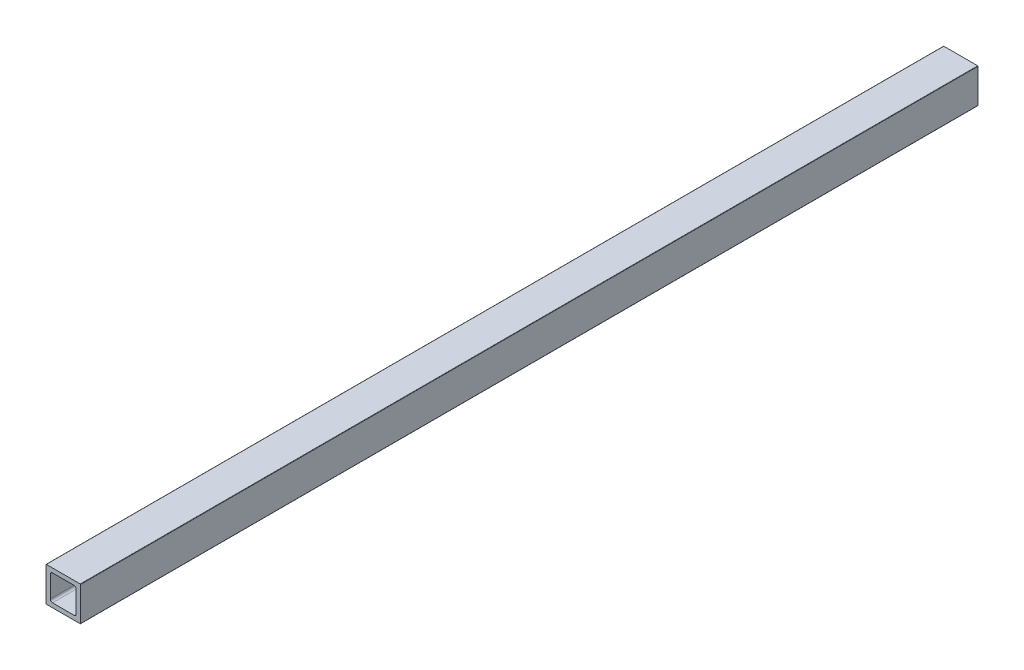
ISO-10303-21;
HEADER;
FILE_DESCRIPTION(('STEP AP214'),'2;1');
FILE_NAME('part.step','',(''),(''),'','','');
FILE_SCHEMA(('AUTOMOTIVE_DESIGN { 1 0 10303 214 1 1 1 1 }'));
ENDSEC;
DATA;
#1=APPLICATION_CONTEXT('core data for automotive mechanical design processes');
#2=APPLICATION_PROTOCOL_DEFINITION('international standard','automotive_design',2000,#1);
#3=PRODUCT_CONTEXT('',#1,'mechanical');
#4=PRODUCT('Part','Part','',(#3));
#5=PRODUCT_RELATED_PRODUCT_CATEGORY('part','',(#4));
#6=PRODUCT_DEFINITION_FORMATION('','',#4);
#7=PRODUCT_DEFINITION_CONTEXT('part definition',#1,'design');
#8=PRODUCT_DEFINITION('design','',#6,#7);
#9=PRODUCT_DEFINITION_SHAPE('','',#8);
#10=(LENGTH_UNIT() NAMED_UNIT(*) SI_UNIT(.MILLI.,.METRE.));
#11=(NAMED_UNIT(*) PLANE_ANGLE_UNIT() SI_UNIT($,.RADIAN.));
#12=(NAMED_UNIT(*) SI_UNIT($,.STERADIAN.) SOLID_ANGLE_UNIT());
#13=UNCERTAINTY_MEASURE_WITH_UNIT(LENGTH_MEASURE(1.E-05),#10,'distance_accuracy_value','');
#14=(GEOMETRIC_REPRESENTATION_CONTEXT(3) GLOBAL_UNCERTAINTY_ASSIGNED_CONTEXT((#13)) GLOBAL_UNIT_ASSIGNED_CONTEXT((#10,
#11,#12)) REPRESENTATION_CONTEXT('',''));
#15=CARTESIAN_POINT('',(0.,0.,0.));
#16=DIRECTION('',(0.,0.,1.));
#17=DIRECTION('',(1.,0.,0.));
#18=AXIS2_PLACEMENT_3D('',#15,#16,#17);
#19=CARTESIAN_POINT('',(3.175,4.7625,1828.8));
#20=DIRECTION('',(1.,0.,0.));
#21=DIRECTION('',(0.,1.,0.));
#22=AXIS2_PLACEMENT_3D('',#19,#20,#21);
#23=PLANE('',#22);
#24=DIRECTION('',(0.,-1.,0.));
#25=VECTOR('',#24,1.);
#26=CARTESIAN_POINT('',(3.175,4.7625,1168.4));
#27=LINE('',#26,#25);
#28=CARTESIAN_POINT('',(3.175,20.6375,1168.4));
#29=VERTEX_POINT('',#28);
#30=CARTESIAN_POINT('',(3.175,4.7625,1168.4));
#31=VERTEX_POINT('',#30);
#32=EDGE_CURVE('E58',#29,#31,#27,.T.);
#33=ORIENTED_EDGE('',*,*,#32,.F.);
#34=DIRECTION('',(0.,0.,-1.));
#35=VECTOR('',#34,1.);
#36=CARTESIAN_POINT('',(3.175,20.6375,1828.8));
#37=LINE('',#36,#35);
#38=CARTESIAN_POINT('',(3.175,20.6375,1828.8));
#39=VERTEX_POINT('',#38);
#40=EDGE_CURVE('E51',#39,#29,#37,.T.);
#41=ORIENTED_EDGE('',*,*,#40,.F.);
#42=DIRECTION('',(0.,-1.,0.));
#43=VECTOR('',#42,1.);
#44=CARTESIAN_POINT('',(3.175,4.7625,1828.8));
#45=LINE('',#44,#43);
#46=CARTESIAN_POINT('',(3.175,4.7625,1828.8));
#47=VERTEX_POINT('',#46);
#48=EDGE_CURVE('E217',#39,#47,#45,.T.);
#49=ORIENTED_EDGE('',*,*,#48,.T.);
#50=DIRECTION('',(0.,0.,-1.));
#51=VECTOR('',#50,1.);
#52=CARTESIAN_POINT('',(3.175,4.7625,1828.8));
#53=LINE('',#52,#51);
#54=EDGE_CURVE('E323',#47,#31,#53,.T.);
#55=ORIENTED_EDGE('',*,*,#54,.T.);
#56=EDGE_LOOP('',(#33,#41,#49,#55));
#57=FACE_BOUND('',#56,.T.);
#58=ADVANCED_FACE('F43',(#57),#23,.T.);
#59=CARTESIAN_POINT('',(4.7625,20.6375,1828.8));
#60=DIRECTION('',(0.,0.,-1.));
#61=DIRECTION('',(-1.,0.,0.));
#62=AXIS2_PLACEMENT_3D('',#59,#60,#61);
#63=CYLINDRICAL_SURFACE('',#62,1.5875);
#64=ORIENTED_EDGE('',*,*,#40,.T.);
#65=CARTESIAN_POINT('',(4.7625,20.6375,1168.4));
#66=DIRECTION('',(0.,0.,1.));
#67=DIRECTION('',(1.,0.,0.));
#68=AXIS2_PLACEMENT_3D('',#65,#66,#67);
#69=CIRCLE('',#68,1.5875);
#70=CARTESIAN_POINT('',(4.7625,22.225,1168.4));
#71=VERTEX_POINT('',#70);
#72=EDGE_CURVE('E302',#29,#71,#69,.F.);
#73=ORIENTED_EDGE('',*,*,#72,.T.);
#74=DIRECTION('',(0.,0.,-1.));
#75=VECTOR('',#74,1.);
#76=CARTESIAN_POINT('',(4.7625,22.225,1828.8));
#77=LINE('',#76,#75);
#78=CARTESIAN_POINT('',(4.7625,22.225,1828.8));
#79=VERTEX_POINT('',#78);
#80=EDGE_CURVE('E290',#79,#71,#77,.T.);
#81=ORIENTED_EDGE('',*,*,#80,.F.);
#82=CARTESIAN_POINT('',(4.7625,20.6375,1828.8));
#83=DIRECTION('',(0.,0.,1.));
#84=DIRECTION('',(-1.,0.,0.));
#85=AXIS2_PLACEMENT_3D('',#82,#83,#84);
#86=CIRCLE('',#85,1.5875);
#87=EDGE_CURVE('E222',#79,#39,#86,.T.);
#88=ORIENTED_EDGE('',*,*,#87,.T.);
#89=EDGE_LOOP('',(#64,#73,#81,#88));
#90=FACE_BOUND('',#89,.T.);
#91=ADVANCED_FACE('F300',(#90),#63,.F.);
#92=CARTESIAN_POINT('',(4.7625,22.225,1828.8));
#93=DIRECTION('',(0.,-1.,0.));
#94=DIRECTION('',(0.,0.,-1.));
#95=AXIS2_PLACEMENT_3D('',#92,#93,#94);
#96=PLANE('',#95);
#97=DIRECTION('',(-1.,0.,0.));
#98=VECTOR('',#97,1.);
#99=CARTESIAN_POINT('',(4.7625,22.225,1168.4));
#100=LINE('',#99,#98);
#101=CARTESIAN_POINT('',(20.6375,22.225,1168.4));
#102=VERTEX_POINT('',#101);
#103=EDGE_CURVE('E338',#102,#71,#100,.T.);
#104=ORIENTED_EDGE('',*,*,#103,.F.);
#105=DIRECTION('',(0.,0.,-1.));
#106=VECTOR('',#105,1.);
#107=CARTESIAN_POINT('',(20.6375,22.225,1828.8));
#108=LINE('',#107,#106);
#109=CARTESIAN_POINT('',(20.6375,22.225,1828.8));
#110=VERTEX_POINT('',#109);
#111=EDGE_CURVE('E237',#110,#102,#108,.T.);
#112=ORIENTED_EDGE('',*,*,#111,.F.);
#113=DIRECTION('',(-1.,0.,0.));
#114=VECTOR('',#113,1.);
#115=CARTESIAN_POINT('',(4.7625,22.225,1828.8));
#116=LINE('',#115,#114);
#117=EDGE_CURVE('E226',#110,#79,#116,.T.);
#118=ORIENTED_EDGE('',*,*,#117,.T.);
#119=ORIENTED_EDGE('',*,*,#80,.T.);
#120=EDGE_LOOP('',(#104,#112,#118,#119));
#121=FACE_BOUND('',#120,.T.);
#122=ADVANCED_FACE('F289',(#121),#96,.T.);
#123=CARTESIAN_POINT('',(20.6375,20.6375,1828.8));
#124=DIRECTION('',(0.,0.,-1.));
#125=DIRECTION('',(-1.,0.,0.));
#126=AXIS2_PLACEMENT_3D('',#123,#124,#125);
#127=CYLINDRICAL_SURFACE('',#126,1.5875);
#128=ORIENTED_EDGE('',*,*,#111,.T.);
#129=CARTESIAN_POINT('',(20.6375,20.6375,1168.4));
#130=DIRECTION('',(0.,0.,1.));
#131=DIRECTION('',(1.,0.,0.));
#132=AXIS2_PLACEMENT_3D('',#129,#130,#131);
#133=CIRCLE('',#132,1.5875);
#134=CARTESIAN_POINT('',(22.225,20.6375,1168.4));
#135=VERTEX_POINT('',#134);
#136=EDGE_CURVE('E340',#102,#135,#133,.F.);
#137=ORIENTED_EDGE('',*,*,#136,.T.);
#138=DIRECTION('',(0.,0.,-1.));
#139=VECTOR('',#138,1.);
#140=CARTESIAN_POINT('',(22.225,20.6375,1828.8));
#141=LINE('',#140,#139);
#142=CARTESIAN_POINT('',(22.225,20.6375,1828.8));
#143=VERTEX_POINT('',#142);
#144=EDGE_CURVE('E233',#143,#135,#141,.T.);
#145=ORIENTED_EDGE('',*,*,#144,.F.);
#146=CARTESIAN_POINT('',(20.6375,20.6375,1828.8));
#147=DIRECTION('',(0.,0.,1.));
#148=DIRECTION('',(-1.,0.,0.));
#149=AXIS2_PLACEMENT_3D('',#146,#147,#148);
#150=CIRCLE('',#149,1.5875);
#151=EDGE_CURVE('E212',#143,#110,#150,.T.);
#152=ORIENTED_EDGE('',*,*,#151,.T.);
#153=EDGE_LOOP('',(#128,#137,#145,#152));
#154=FACE_BOUND('',#153,.T.);
#155=ADVANCED_FACE('F525',(#154),#127,.F.);
#156=CARTESIAN_POINT('',(22.225,4.7625,1828.8));
#157=DIRECTION('',(-1.,0.,0.));
#158=DIRECTION('',(0.,0.,1.));
#159=AXIS2_PLACEMENT_3D('',#156,#157,#158);
#160=PLANE('',#159);
#161=DIRECTION('',(0.,1.,0.));
#162=VECTOR('',#161,1.);
#163=CARTESIAN_POINT('',(22.225,4.7625,1168.4));
#164=LINE('',#163,#162);
#165=CARTESIAN_POINT('',(22.225,4.7625,1168.4));
#166=VERTEX_POINT('',#165);
#167=EDGE_CURVE('E343',#166,#135,#164,.T.);
#168=ORIENTED_EDGE('',*,*,#167,.F.);
#169=DIRECTION('',(0.,0.,-1.));
#170=VECTOR('',#169,1.);
#171=CARTESIAN_POINT('',(22.225,4.7625,1828.8));
#172=LINE('',#171,#170);
#173=CARTESIAN_POINT('',(22.225,4.7625,1828.8));
#174=VERTEX_POINT('',#173);
#175=EDGE_CURVE('E238',#174,#166,#172,.T.);
#176=ORIENTED_EDGE('',*,*,#175,.F.);
#177=DIRECTION('',(0.,1.,0.));
#178=VECTOR('',#177,1.);
#179=CARTESIAN_POINT('',(22.225,4.7625,1828.8));
#180=LINE('',#179,#178);
#181=EDGE_CURVE('E207',#174,#143,#180,.T.);
#182=ORIENTED_EDGE('',*,*,#181,.T.);
#183=ORIENTED_EDGE('',*,*,#144,.T.);
#184=EDGE_LOOP('',(#168,#176,#182,#183));
#185=FACE_BOUND('',#184,.T.);
#186=ADVANCED_FACE('F395',(#185),#160,.T.);
#187=CARTESIAN_POINT('',(20.6375,4.7625,1828.8));
#188=DIRECTION('',(0.,0.,-1.));
#189=DIRECTION('',(-1.,0.,0.));
#190=AXIS2_PLACEMENT_3D('',#187,#188,#189);
#191=CYLINDRICAL_SURFACE('',#190,1.5875);
#192=ORIENTED_EDGE('',*,*,#175,.T.);
#193=CARTESIAN_POINT('',(20.6375,4.7625,1168.4));
#194=DIRECTION('',(0.,0.,1.));
#195=DIRECTION('',(1.,0.,0.));
#196=AXIS2_PLACEMENT_3D('',#193,#194,#195);
#197=CIRCLE('',#196,1.5875);
#198=CARTESIAN_POINT('',(20.6375,3.175,1168.4));
#199=VERTEX_POINT('',#198);
#200=EDGE_CURVE('E345',#166,#199,#197,.F.);
#201=ORIENTED_EDGE('',*,*,#200,.T.);
#202=DIRECTION('',(0.,0.,-1.));
#203=VECTOR('',#202,1.);
#204=CARTESIAN_POINT('',(20.6375,3.175,1828.8));
#205=LINE('',#204,#203);
#206=CARTESIAN_POINT('',(20.6375,3.175,1828.8));
#207=VERTEX_POINT('',#206);
#208=EDGE_CURVE('E264',#207,#199,#205,.T.);
#209=ORIENTED_EDGE('',*,*,#208,.F.);
#210=CARTESIAN_POINT('',(20.6375,4.7625,1828.8));
#211=DIRECTION('',(0.,0.,1.));
#212=DIRECTION('',(-1.,0.,0.));
#213=AXIS2_PLACEMENT_3D('',#210,#211,#212);
#214=CIRCLE('',#213,1.5875);
#215=EDGE_CURVE('E211',#207,#174,#214,.T.);
#216=ORIENTED_EDGE('',*,*,#215,.T.);
#217=EDGE_LOOP('',(#192,#201,#209,#216));
#218=FACE_BOUND('',#217,.T.);
#219=ADVANCED_FACE('F392',(#218),#191,.F.);
#220=CARTESIAN_POINT('',(4.7625,3.175,1828.8));
#221=DIRECTION('',(0.,1.,0.));
#222=DIRECTION('',(1.,0.,0.));
#223=AXIS2_PLACEMENT_3D('',#220,#221,#222);
#224=PLANE('',#223);
#225=DIRECTION('',(1.,0.,0.));
#226=VECTOR('',#225,1.);
#227=CARTESIAN_POINT('',(4.7625,3.175,1168.4));
#228=LINE('',#227,#226);
#229=CARTESIAN_POINT('',(4.7625,3.175,1168.4));
#230=VERTEX_POINT('',#229);
#231=EDGE_CURVE('E348',#230,#199,#228,.T.);
#232=ORIENTED_EDGE('',*,*,#231,.F.);
#233=DIRECTION('',(0.,0.,-1.));
#234=VECTOR('',#233,1.);
#235=CARTESIAN_POINT('',(4.7625,3.175,1828.8));
#236=LINE('',#235,#234);
#237=CARTESIAN_POINT('',(4.7625,3.175,1828.8));
#238=VERTEX_POINT('',#237);
#239=EDGE_CURVE('E268',#238,#230,#236,.T.);
#240=ORIENTED_EDGE('',*,*,#239,.F.);
#241=DIRECTION('',(1.,0.,0.));
#242=VECTOR('',#241,1.);
#243=CARTESIAN_POINT('',(4.7625,3.175,1828.8));
#244=LINE('',#243,#242);
#245=EDGE_CURVE('E254',#238,#207,#244,.T.);
#246=ORIENTED_EDGE('',*,*,#245,.T.);
#247=ORIENTED_EDGE('',*,*,#208,.T.);
#248=EDGE_LOOP('',(#232,#240,#246,#247));
#249=FACE_BOUND('',#248,.T.);
#250=ADVANCED_FACE('F394',(#249),#224,.T.);
#251=CARTESIAN_POINT('',(4.7625,4.7625,1828.8));
#252=DIRECTION('',(0.,0.,-1.));
#253=DIRECTION('',(-1.,0.,0.));
#254=AXIS2_PLACEMENT_3D('',#251,#252,#253);
#255=CYLINDRICAL_SURFACE('',#254,1.5875);
#256=ORIENTED_EDGE('',*,*,#239,.T.);
#257=CARTESIAN_POINT('',(4.7625,4.7625,1168.4));
#258=DIRECTION('',(0.,0.,1.));
#259=DIRECTION('',(1.,0.,0.));
#260=AXIS2_PLACEMENT_3D('',#257,#258,#259);
#261=CIRCLE('',#260,1.5875);
#262=EDGE_CURVE('E350',#230,#31,#261,.F.);
#263=ORIENTED_EDGE('',*,*,#262,.T.);
#264=ORIENTED_EDGE('',*,*,#54,.F.);
#265=CARTESIAN_POINT('',(4.7625,4.7625,1828.8));
#266=DIRECTION('',(0.,0.,1.));
#267=DIRECTION('',(1.,0.,0.));
#268=AXIS2_PLACEMENT_3D('',#265,#266,#267);
#269=CIRCLE('',#268,1.5875);
#270=EDGE_CURVE('E213',#47,#238,#269,.T.);
#271=ORIENTED_EDGE('',*,*,#270,.T.);
#272=EDGE_LOOP('',(#256,#263,#264,#271));
#273=FACE_BOUND('',#272,.T.);
#274=ADVANCED_FACE('F508',(#273),#255,.F.);
#275=CARTESIAN_POINT('',(0.,0.254,1828.8));
#276=DIRECTION('',(1.,0.,0.));
#277=DIRECTION('',(0.,1.,0.));
#278=AXIS2_PLACEMENT_3D('',#275,#276,#277);
#279=PLANE('',#278);
#280=DIRECTION('',(0.,0.,-1.));
#281=VECTOR('',#280,1.);
#282=CARTESIAN_POINT('',(0.,25.146,1828.8));
#283=LINE('',#282,#281);
#284=CARTESIAN_POINT('',(0.,25.146,1828.8));
#285=VERTEX_POINT('',#284);
#286=CARTESIAN_POINT('',(0.,25.146,1168.4));
#287=VERTEX_POINT('',#286);
#288=EDGE_CURVE('E263',#285,#287,#283,.T.);
#289=ORIENTED_EDGE('',*,*,#288,.T.);
#290=DIRECTION('',(0.,-1.,0.));
#291=VECTOR('',#290,1.);
#292=CARTESIAN_POINT('',(0.,0.254,1168.4));
#293=LINE('',#292,#291);
#294=CARTESIAN_POINT('',(0.,0.254,1168.4));
#295=VERTEX_POINT('',#294);
#296=EDGE_CURVE('E185',#287,#295,#293,.T.);
#297=ORIENTED_EDGE('',*,*,#296,.T.);
#298=DIRECTION('',(0.,0.,-1.));
#299=VECTOR('',#298,1.);
#300=CARTESIAN_POINT('',(0.,0.254,1828.8));
#301=LINE('',#300,#299);
#302=CARTESIAN_POINT('',(0.,0.254,1828.8));
#303=VERTEX_POINT('',#302);
#304=EDGE_CURVE('E194',#303,#295,#301,.T.);
#305=ORIENTED_EDGE('',*,*,#304,.F.);
#306=DIRECTION('',(0.,-1.,0.));
#307=VECTOR('',#306,1.);
#308=CARTESIAN_POINT('',(0.,0.254,1828.8));
#309=LINE('',#308,#307);
#310=EDGE_CURVE('E218',#285,#303,#309,.T.);
#311=ORIENTED_EDGE('',*,*,#310,.F.);
#312=EDGE_LOOP('',(#289,#297,#305,#311));
#313=FACE_BOUND('',#312,.T.);
#314=ADVANCED_FACE('F502',(#313),#279,.F.);
#315=CARTESIAN_POINT('',(0.254,25.146,1828.8));
#316=DIRECTION('',(0.,0.,-1.));
#317=DIRECTION('',(-1.,0.,0.));
#318=AXIS2_PLACEMENT_3D('',#315,#316,#317);
#319=CYLINDRICAL_SURFACE('',#318,0.254);
#320=CARTESIAN_POINT('',(0.254,25.146,1168.4));
#321=DIRECTION('',(0.,0.,1.));
#322=DIRECTION('',(1.,0.,0.));
#323=AXIS2_PLACEMENT_3D('',#320,#321,#322);
#324=CIRCLE('',#323,0.254);
#325=CARTESIAN_POINT('',(0.254000000000004,25.4,1168.4));
#326=VERTEX_POINT('',#325);
#327=EDGE_CURVE('E176',#287,#326,#324,.F.);
#328=ORIENTED_EDGE('',*,*,#327,.F.);
#329=ORIENTED_EDGE('',*,*,#288,.F.);
#330=CARTESIAN_POINT('',(0.254,25.146,1828.8));
#331=DIRECTION('',(0.,0.,1.));
#332=DIRECTION('',(-1.,0.,0.));
#333=AXIS2_PLACEMENT_3D('',#330,#331,#332);
#334=CIRCLE('',#333,0.254);
#335=CARTESIAN_POINT('',(0.254,25.4,1828.8));
#336=VERTEX_POINT('',#335);
#337=EDGE_CURVE('E239',#336,#285,#334,.T.);
#338=ORIENTED_EDGE('',*,*,#337,.F.);
#339=DIRECTION('',(0.,0.,-1.));
#340=VECTOR('',#339,1.);
#341=CARTESIAN_POINT('',(0.254,25.4,1828.8));
#342=LINE('',#341,#340);
#343=EDGE_CURVE('E259',#336,#326,#342,.T.);
#344=ORIENTED_EDGE('',*,*,#343,.T.);
#345=EDGE_LOOP('',(#328,#329,#338,#344));
#346=FACE_BOUND('',#345,.T.);
#347=ADVANCED_FACE('F507',(#346),#319,.T.);
#348=CARTESIAN_POINT('',(0.254,25.4,1828.8));
#349=DIRECTION('',(0.,-1.,0.));
#350=DIRECTION('',(0.,0.,-1.));
#351=AXIS2_PLACEMENT_3D('',#348,#349,#350);
#352=PLANE('',#351);
#353=DIRECTION('',(0.,0.,-1.));
#354=VECTOR('',#353,1.);
#355=CARTESIAN_POINT('',(25.146,25.4,1828.8));
#356=LINE('',#355,#354);
#357=CARTESIAN_POINT('',(25.146,25.4,1828.8));
#358=VERTEX_POINT('',#357);
#359=CARTESIAN_POINT('',(25.146,25.4,1168.4));
#360=VERTEX_POINT('',#359);
#361=EDGE_CURVE('E255',#358,#360,#356,.T.);
#362=ORIENTED_EDGE('',*,*,#361,.T.);
#363=DIRECTION('',(1.,0.,0.));
#364=VECTOR('',#363,1.);
#365=CARTESIAN_POINT('',(-135.222379220066,25.4,1168.4));
#366=LINE('',#365,#364);
#367=EDGE_CURVE('E186',#326,#360,#366,.T.);
#368=ORIENTED_EDGE('',*,*,#367,.F.);
#369=ORIENTED_EDGE('',*,*,#343,.F.);
#370=DIRECTION('',(-1.,0.,0.));
#371=VECTOR('',#370,1.);
#372=CARTESIAN_POINT('',(0.254,25.4,1828.8));
#373=LINE('',#372,#371);
#374=EDGE_CURVE('E231',#358,#336,#373,.T.);
#375=ORIENTED_EDGE('',*,*,#374,.F.);
#376=EDGE_LOOP('',(#362,#368,#369,#375));
#377=FACE_BOUND('',#376,.T.);
#378=ADVANCED_FACE('F365',(#377),#352,.F.);
#379=CARTESIAN_POINT('',(25.146,25.146,1828.8));
#380=DIRECTION('',(0.,0.,-1.));
#381=DIRECTION('',(-1.,0.,0.));
#382=AXIS2_PLACEMENT_3D('',#379,#380,#381);
#383=CYLINDRICAL_SURFACE('',#382,0.254);
#384=CARTESIAN_POINT('',(25.146,25.146,1168.4));
#385=DIRECTION('',(0.,0.,1.));
#386=DIRECTION('',(1.,0.,0.));
#387=AXIS2_PLACEMENT_3D('',#384,#385,#386);
#388=CIRCLE('',#387,0.254);
#389=CARTESIAN_POINT('',(25.4,25.146,1168.4));
#390=VERTEX_POINT('',#389);
#391=EDGE_CURVE('E352',#360,#390,#388,.F.);
#392=ORIENTED_EDGE('',*,*,#391,.F.);
#393=ORIENTED_EDGE('',*,*,#361,.F.);
#394=CARTESIAN_POINT('',(25.146,25.146,1828.8));
#395=DIRECTION('',(0.,0.,1.));
#396=DIRECTION('',(-1.,0.,0.));
#397=AXIS2_PLACEMENT_3D('',#394,#395,#396);
#398=CIRCLE('',#397,0.254);
#399=CARTESIAN_POINT('',(25.4,25.146,1828.8));
#400=VERTEX_POINT('',#399);
#401=EDGE_CURVE('E227',#400,#358,#398,.T.);
#402=ORIENTED_EDGE('',*,*,#401,.F.);
#403=DIRECTION('',(0.,0.,-1.));
#404=VECTOR('',#403,1.);
#405=CARTESIAN_POINT('',(25.4,25.146,1828.8));
#406=LINE('',#405,#404);
#407=EDGE_CURVE('E200',#400,#390,#406,.T.);
#408=ORIENTED_EDGE('',*,*,#407,.T.);
#409=EDGE_LOOP('',(#392,#393,#402,#408));
#410=FACE_BOUND('',#409,.T.);
#411=ADVANCED_FACE('F45',(#410),#383,.T.);
#412=CARTESIAN_POINT('',(25.4,0.254,1828.8));
#413=DIRECTION('',(-1.,0.,0.));
#414=DIRECTION('',(0.,0.,1.));
#415=AXIS2_PLACEMENT_3D('',#412,#413,#414);
#416=PLANE('',#415);
#417=DIRECTION('',(0.,0.,-1.));
#418=VECTOR('',#417,1.);
#419=CARTESIAN_POINT('',(25.4,0.254,1828.8));
#420=LINE('',#419,#418);
#421=CARTESIAN_POINT('',(25.4,0.254,1828.8));
#422=VERTEX_POINT('',#421);
#423=CARTESIAN_POINT('',(25.4,0.254,1168.4));
#424=VERTEX_POINT('',#423);
#425=EDGE_CURVE('E193',#422,#424,#420,.T.);
#426=ORIENTED_EDGE('',*,*,#425,.T.);
#427=DIRECTION('',(0.,1.,0.));
#428=VECTOR('',#427,1.);
#429=CARTESIAN_POINT('',(25.4,0.254,1168.4));
#430=LINE('',#429,#428);
#431=EDGE_CURVE('E172',#424,#390,#430,.T.);
#432=ORIENTED_EDGE('',*,*,#431,.T.);
#433=ORIENTED_EDGE('',*,*,#407,.F.);
#434=DIRECTION('',(0.,1.,0.));
#435=VECTOR('',#434,1.);
#436=CARTESIAN_POINT('',(25.4,0.254,1828.8));
#437=LINE('',#436,#435);
#438=EDGE_CURVE('E232',#422,#400,#437,.T.);
#439=ORIENTED_EDGE('',*,*,#438,.F.);
#440=EDGE_LOOP('',(#426,#432,#433,#439));
#441=FACE_BOUND('',#440,.T.);
#442=ADVANCED_FACE('F369',(#441),#416,.F.);
#443=CARTESIAN_POINT('',(25.146,0.254,1828.8));
#444=DIRECTION('',(0.,0.,-1.));
#445=DIRECTION('',(-1.,0.,0.));
#446=AXIS2_PLACEMENT_3D('',#443,#444,#445);
#447=CYLINDRICAL_SURFACE('',#446,0.254);
#448=CARTESIAN_POINT('',(25.146,0.254,1168.4));
#449=DIRECTION('',(0.,0.,1.));
#450=DIRECTION('',(1.,0.,0.));
#451=AXIS2_PLACEMENT_3D('',#448,#449,#450);
#452=CIRCLE('',#451,0.254);
#453=CARTESIAN_POINT('',(25.146,0.,1168.4));
#454=VERTEX_POINT('',#453);
#455=EDGE_CURVE('E169',#424,#454,#452,.F.);
#456=ORIENTED_EDGE('',*,*,#455,.F.);
#457=ORIENTED_EDGE('',*,*,#425,.F.);
#458=CARTESIAN_POINT('',(25.146,0.254,1828.8));
#459=DIRECTION('',(0.,0.,1.));
#460=DIRECTION('',(1.,0.,0.));
#461=AXIS2_PLACEMENT_3D('',#458,#459,#460);
#462=CIRCLE('',#461,0.254);
#463=CARTESIAN_POINT('',(25.146,0.,1828.8));
#464=VERTEX_POINT('',#463);
#465=EDGE_CURVE('E190',#464,#422,#462,.T.);
#466=ORIENTED_EDGE('',*,*,#465,.F.);
#467=DIRECTION('',(0.,0.,-1.));
#468=VECTOR('',#467,1.);
#469=CARTESIAN_POINT('',(25.146,0.,1828.8));
#470=LINE('',#469,#468);
#471=EDGE_CURVE('E182',#464,#454,#470,.T.);
#472=ORIENTED_EDGE('',*,*,#471,.T.);
#473=EDGE_LOOP('',(#456,#457,#466,#472));
#474=FACE_BOUND('',#473,.T.);
#475=ADVANCED_FACE('F188',(#474),#447,.T.);
#476=CARTESIAN_POINT('',(0.254,0.,1828.8));
#477=DIRECTION('',(0.,1.,0.));
#478=DIRECTION('',(1.,0.,0.));
#479=AXIS2_PLACEMENT_3D('',#476,#477,#478);
#480=PLANE('',#479);
#481=DIRECTION('',(0.,0.,-1.));
#482=VECTOR('',#481,1.);
#483=CARTESIAN_POINT('',(0.254,0.,1828.8));
#484=LINE('',#483,#482);
#485=CARTESIAN_POINT('',(0.254,0.,1828.8));
#486=VERTEX_POINT('',#485);
#487=CARTESIAN_POINT('',(0.254,0.,1168.4));
#488=VERTEX_POINT('',#487);
#489=EDGE_CURVE('E184',#486,#488,#484,.T.);
#490=ORIENTED_EDGE('',*,*,#489,.T.);
#491=DIRECTION('',(-1.,0.,0.));
#492=VECTOR('',#491,1.);
#493=CARTESIAN_POINT('',(-135.222379220066,0.,1168.4));
#494=LINE('',#493,#492);
#495=EDGE_CURVE('E65',#454,#488,#494,.T.);
#496=ORIENTED_EDGE('',*,*,#495,.F.);
#497=ORIENTED_EDGE('',*,*,#471,.F.);
#498=DIRECTION('',(1.,0.,0.));
#499=VECTOR('',#498,1.);
#500=CARTESIAN_POINT('',(0.254,0.,1828.8));
#501=LINE('',#500,#499);
#502=EDGE_CURVE('E248',#486,#464,#501,.T.);
#503=ORIENTED_EDGE('',*,*,#502,.F.);
#504=EDGE_LOOP('',(#490,#496,#497,#503));
#505=FACE_BOUND('',#504,.T.);
#506=ADVANCED_FACE('F180',(#505),#480,.F.);
#507=CARTESIAN_POINT('',(0.254,0.254,1828.8));
#508=DIRECTION('',(0.,0.,-1.));
#509=DIRECTION('',(-1.,0.,0.));
#510=AXIS2_PLACEMENT_3D('',#507,#508,#509);
#511=CYLINDRICAL_SURFACE('',#510,0.254);
#512=CARTESIAN_POINT('',(0.254,0.254,1168.4));
#513=DIRECTION('',(0.,0.,1.));
#514=DIRECTION('',(1.,0.,0.));
#515=AXIS2_PLACEMENT_3D('',#512,#513,#514);
#516=CIRCLE('',#515,0.254);
#517=EDGE_CURVE('E11',#488,#295,#516,.F.);
#518=ORIENTED_EDGE('',*,*,#517,.F.);
#519=ORIENTED_EDGE('',*,*,#489,.F.);
#520=CARTESIAN_POINT('',(0.254,0.254,1828.8));
#521=DIRECTION('',(0.,0.,1.));
#522=DIRECTION('',(-1.,0.,0.));
#523=AXIS2_PLACEMENT_3D('',#520,#521,#522);
#524=CIRCLE('',#523,0.254);
#525=EDGE_CURVE('E251',#303,#486,#524,.T.);
#526=ORIENTED_EDGE('',*,*,#525,.F.);
#527=ORIENTED_EDGE('',*,*,#304,.T.);
#528=EDGE_LOOP('',(#518,#519,#526,#527));
#529=FACE_BOUND('',#528,.T.);
#530=ADVANCED_FACE('F388',(#529),#511,.T.);
#531=CARTESIAN_POINT('',(0.254,0.254,1828.8));
#532=DIRECTION('',(0.,0.,-1.));
#533=DIRECTION('',(0.,-1.,0.));
#534=AXIS2_PLACEMENT_3D('',#531,#532,#533);
#535=PLANE('',#534);
#536=ORIENTED_EDGE('',*,*,#270,.F.);
#537=ORIENTED_EDGE('',*,*,#48,.F.);
#538=ORIENTED_EDGE('',*,*,#87,.F.);
#539=ORIENTED_EDGE('',*,*,#117,.F.);
#540=ORIENTED_EDGE('',*,*,#151,.F.);
#541=ORIENTED_EDGE('',*,*,#181,.F.);
#542=ORIENTED_EDGE('',*,*,#215,.F.);
#543=ORIENTED_EDGE('',*,*,#245,.F.);
#544=EDGE_LOOP('',(#536,#537,#538,#539,#540,#541,#542,#543));
#545=FACE_BOUND('',#544,.T.);
#546=ORIENTED_EDGE('',*,*,#525,.T.);
#547=ORIENTED_EDGE('',*,*,#502,.T.);
#548=ORIENTED_EDGE('',*,*,#465,.T.);
#549=ORIENTED_EDGE('',*,*,#438,.T.);
#550=ORIENTED_EDGE('',*,*,#401,.T.);
#551=ORIENTED_EDGE('',*,*,#374,.T.);
#552=ORIENTED_EDGE('',*,*,#337,.T.);
#553=ORIENTED_EDGE('',*,*,#310,.T.);
#554=EDGE_LOOP('',(#546,#547,#548,#549,#550,#551,#552,#553));
#555=FACE_BOUND('',#554,.T.);
#556=ADVANCED_FACE('F296',(#545,#555),#535,.F.);
#557=CARTESIAN_POINT('',(-135.222379220066,-1199.2675940706,1168.4));
#558=DIRECTION('',(0.,0.,1.));
#559=DIRECTION('',(1.,0.,0.));
#560=AXIS2_PLACEMENT_3D('',#557,#558,#559);
#561=PLANE('',#560);
#562=ORIENTED_EDGE('',*,*,#32,.T.);
#563=ORIENTED_EDGE('',*,*,#262,.F.);
#564=ORIENTED_EDGE('',*,*,#231,.T.);
#565=ORIENTED_EDGE('',*,*,#200,.F.);
#566=ORIENTED_EDGE('',*,*,#167,.T.);
#567=ORIENTED_EDGE('',*,*,#136,.F.);
#568=ORIENTED_EDGE('',*,*,#103,.T.);
#569=ORIENTED_EDGE('',*,*,#72,.F.);
#570=EDGE_LOOP('',(#562,#563,#564,#565,#566,#567,#568,#569));
#571=FACE_BOUND('',#570,.T.);
#572=ORIENTED_EDGE('',*,*,#391,.T.);
#573=ORIENTED_EDGE('',*,*,#431,.F.);
#574=ORIENTED_EDGE('',*,*,#455,.T.);
#575=ORIENTED_EDGE('',*,*,#495,.T.);
#576=ORIENTED_EDGE('',*,*,#517,.T.);
#577=ORIENTED_EDGE('',*,*,#296,.F.);
#578=ORIENTED_EDGE('',*,*,#327,.T.);
#579=ORIENTED_EDGE('',*,*,#367,.T.);
#580=EDGE_LOOP('',(#572,#573,#574,#575,#576,#577,#578,#579));
#581=FACE_BOUND('',#580,.T.);
#582=ADVANCED_FACE('F170',(#571,#581),#561,.F.);
#583=CLOSED_SHELL('',(#58,#91,#122,#155,#186,#219,#250,#274,#314,#347,#378,#411,#442,#475,#506,
#530,#556,#582));
#584=MANIFOLD_SOLID_BREP('B2',#583);
#585=ADVANCED_BREP_SHAPE_REPRESENTATION('',(#18,#584),#14);
#586=SHAPE_DEFINITION_REPRESENTATION(#9,#585);
ENDSEC;
END-ISO-10303-21;
